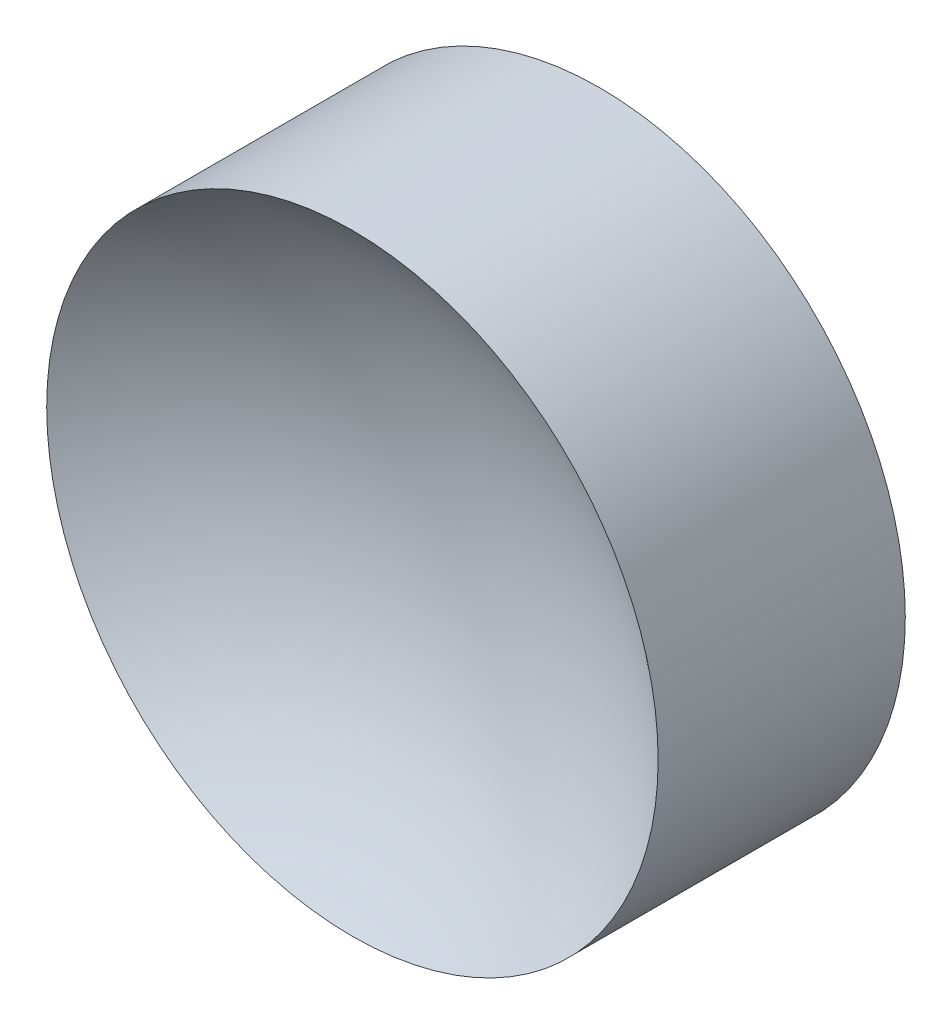
ISO-10303-21;
HEADER;
FILE_DESCRIPTION(('STEP AP214'),'2;1');
FILE_NAME('part.step','',(''),(''),'','','');
FILE_SCHEMA(('AUTOMOTIVE_DESIGN { 1 0 10303 214 1 1 1 1 }'));
ENDSEC;
DATA;
#1=APPLICATION_CONTEXT('core data for automotive mechanical design processes');
#2=APPLICATION_PROTOCOL_DEFINITION('international standard','automotive_design',2000,#1);
#3=PRODUCT_CONTEXT('',#1,'mechanical');
#4=PRODUCT('Part','Part','',(#3));
#5=PRODUCT_RELATED_PRODUCT_CATEGORY('part','',(#4));
#6=PRODUCT_DEFINITION_FORMATION('','',#4);
#7=PRODUCT_DEFINITION_CONTEXT('part definition',#1,'design');
#8=PRODUCT_DEFINITION('design','',#6,#7);
#9=PRODUCT_DEFINITION_SHAPE('','',#8);
#10=(LENGTH_UNIT() NAMED_UNIT(*) SI_UNIT(.MILLI.,.METRE.));
#11=(NAMED_UNIT(*) PLANE_ANGLE_UNIT() SI_UNIT($,.RADIAN.));
#12=(NAMED_UNIT(*) SI_UNIT($,.STERADIAN.) SOLID_ANGLE_UNIT());
#13=UNCERTAINTY_MEASURE_WITH_UNIT(LENGTH_MEASURE(1.E-05),#10,'distance_accuracy_value','');
#14=(GEOMETRIC_REPRESENTATION_CONTEXT(3) GLOBAL_UNCERTAINTY_ASSIGNED_CONTEXT((#13)) GLOBAL_UNIT_ASSIGNED_CONTEXT((#10,
#11,#12)) REPRESENTATION_CONTEXT('',''));
#15=CARTESIAN_POINT('',(0.,0.,0.));
#16=DIRECTION('',(0.,0.,1.));
#17=DIRECTION('',(1.,0.,0.));
#18=AXIS2_PLACEMENT_3D('',#15,#16,#17);
#19=CARTESIAN_POINT('',(0.,0.,8.));
#20=DIRECTION('',(0.,0.,1.));
#21=DIRECTION('',(0.,1.,0.));
#22=AXIS2_PLACEMENT_3D('',#19,#20,#21);
#23=SPHERICAL_SURFACE('',#22,7.);
#24=CARTESIAN_POINT('',(0.,0.,2.6380973526182));
#25=DIRECTION('',(0.,0.,1.));
#26=DIRECTION('',(1.,0.,0.));
#27=AXIS2_PLACEMENT_3D('',#24,#25,#26);
#28=CIRCLE('',#27,4.5);
#29=CARTESIAN_POINT('',(4.5,0.,2.6380973526182));
#30=VERTEX_POINT('',#29);
#31=EDGE_CURVE('E19',#30,#30,#28,.T.);
#32=ORIENTED_EDGE('',*,*,#31,.T.);
#33=EDGE_LOOP('',(#32));
#34=FACE_BOUND('',#33,.T.);
#35=ADVANCED_FACE('F13',(#34),#23,.F.);
#36=CARTESIAN_POINT('',(0.,0.,-1.));
#37=DIRECTION('',(0.,0.,1.));
#38=DIRECTION('',(1.,0.,0.));
#39=AXIS2_PLACEMENT_3D('',#36,#37,#38);
#40=PLANE('',#39);
#41=CARTESIAN_POINT('',(0.,0.,-1.));
#42=DIRECTION('',(0.,0.,1.));
#43=DIRECTION('',(1.,0.,0.));
#44=AXIS2_PLACEMENT_3D('',#41,#42,#43);
#45=CIRCLE('',#44,4.5);
#46=CARTESIAN_POINT('',(4.5,0.,-1.));
#47=VERTEX_POINT('',#46);
#48=EDGE_CURVE('E9',#47,#47,#45,.T.);
#49=ORIENTED_EDGE('',*,*,#48,.F.);
#50=EDGE_LOOP('',(#49));
#51=FACE_BOUND('',#50,.T.);
#52=ADVANCED_FACE('F28',(#51),#40,.F.);
#53=CARTESIAN_POINT('',(0.,0.,9.01715327042933));
#54=DIRECTION('',(0.,0.,1.));
#55=DIRECTION('',(1.,0.,0.));
#56=AXIS2_PLACEMENT_3D('',#53,#54,#55);
#57=CYLINDRICAL_SURFACE('',#56,4.5);
#58=ORIENTED_EDGE('',*,*,#31,.F.);
#59=EDGE_LOOP('',(#58));
#60=FACE_BOUND('',#59,.T.);
#61=ORIENTED_EDGE('',*,*,#48,.T.);
#62=EDGE_LOOP('',(#61));
#63=FACE_BOUND('',#62,.T.);
#64=ADVANCED_FACE('F26',(#60,#63),#57,.T.);
#65=CLOSED_SHELL('',(#35,#52,#64));
#66=MANIFOLD_SOLID_BREP('B1',#65);
#67=ADVANCED_BREP_SHAPE_REPRESENTATION('',(#18,#66),#14);
#68=SHAPE_DEFINITION_REPRESENTATION(#9,#67);
ENDSEC;
END-ISO-10303-21;
